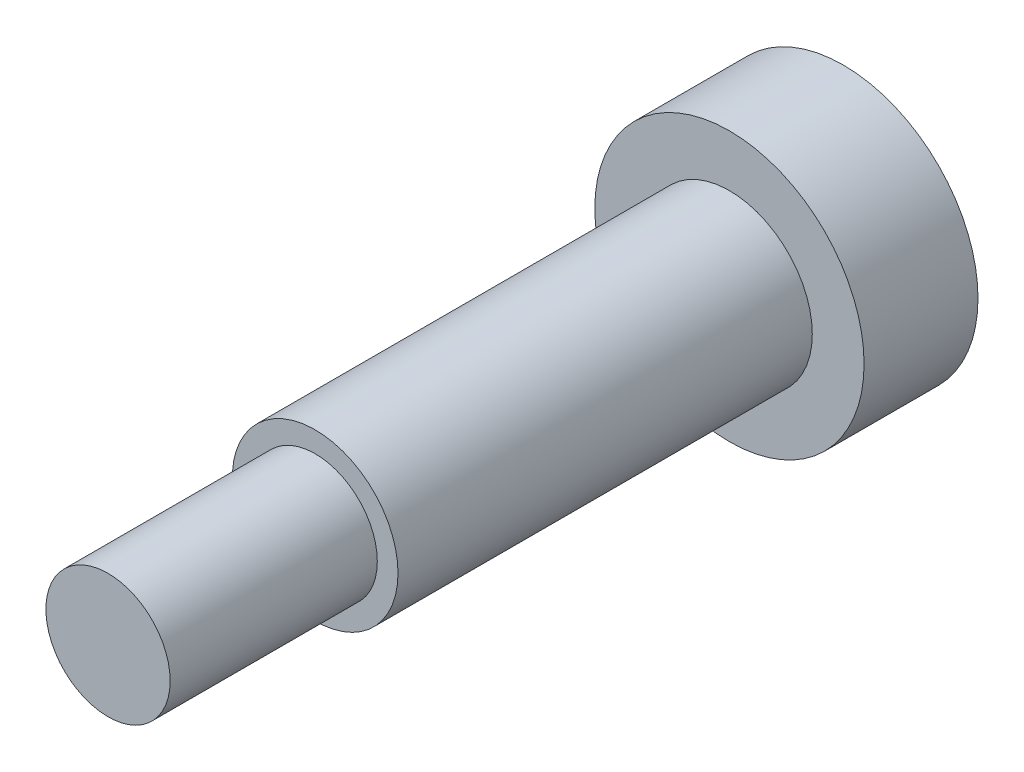
ISO-10303-21;
HEADER;
FILE_DESCRIPTION(('STEP AP214'),'2;1');
FILE_NAME('part.step','',(''),(''),'','','');
FILE_SCHEMA(('AUTOMOTIVE_DESIGN { 1 0 10303 214 1 1 1 1 }'));
ENDSEC;
DATA;
#1=APPLICATION_CONTEXT('core data for automotive mechanical design processes');
#2=APPLICATION_PROTOCOL_DEFINITION('international standard','automotive_design',2000,#1);
#3=PRODUCT_CONTEXT('',#1,'mechanical');
#4=PRODUCT('Part','Part','',(#3));
#5=PRODUCT_RELATED_PRODUCT_CATEGORY('part','',(#4));
#6=PRODUCT_DEFINITION_FORMATION('','',#4);
#7=PRODUCT_DEFINITION_CONTEXT('part definition',#1,'design');
#8=PRODUCT_DEFINITION('design','',#6,#7);
#9=PRODUCT_DEFINITION_SHAPE('','',#8);
#10=(LENGTH_UNIT() NAMED_UNIT(*) SI_UNIT(.MILLI.,.METRE.));
#11=(NAMED_UNIT(*) PLANE_ANGLE_UNIT() SI_UNIT($,.RADIAN.));
#12=(NAMED_UNIT(*) SI_UNIT($,.STERADIAN.) SOLID_ANGLE_UNIT());
#13=UNCERTAINTY_MEASURE_WITH_UNIT(LENGTH_MEASURE(1.E-05),#10,'distance_accuracy_value','');
#14=(GEOMETRIC_REPRESENTATION_CONTEXT(3) GLOBAL_UNCERTAINTY_ASSIGNED_CONTEXT((#13)) GLOBAL_UNIT_ASSIGNED_CONTEXT((#10,
#11,#12)) REPRESENTATION_CONTEXT('',''));
#15=CARTESIAN_POINT('',(0.,0.,0.));
#16=DIRECTION('',(0.,0.,1.));
#17=DIRECTION('',(1.,0.,0.));
#18=AXIS2_PLACEMENT_3D('',#15,#16,#17);
#19=CARTESIAN_POINT('',(0.,0.,20.));
#20=DIRECTION('',(0.,0.,-1.));
#21=DIRECTION('',(-1.,0.,0.));
#22=AXIS2_PLACEMENT_3D('',#19,#20,#21);
#23=CYLINDRICAL_SURFACE('',#22,4.);
#24=CARTESIAN_POINT('',(0.,0.,20.));
#25=DIRECTION('',(0.,0.,1.));
#26=DIRECTION('',(1.,0.,0.));
#27=AXIS2_PLACEMENT_3D('',#24,#25,#26);
#28=CIRCLE('',#27,4.);
#29=CARTESIAN_POINT('',(4.,0.,20.));
#30=VERTEX_POINT('',#29);
#31=EDGE_CURVE('E41',#30,#30,#28,.T.);
#32=ORIENTED_EDGE('',*,*,#31,.F.);
#33=EDGE_LOOP('',(#32));
#34=FACE_BOUND('',#33,.T.);
#35=CARTESIAN_POINT('',(0.,0.,0.));
#36=DIRECTION('',(0.,0.,1.));
#37=DIRECTION('',(1.,0.,0.));
#38=AXIS2_PLACEMENT_3D('',#35,#36,#37);
#39=CIRCLE('',#38,4.);
#40=CARTESIAN_POINT('',(4.,0.,0.));
#41=VERTEX_POINT('',#40);
#42=EDGE_CURVE('E37',#41,#41,#39,.T.);
#43=ORIENTED_EDGE('',*,*,#42,.T.);
#44=EDGE_LOOP('',(#43));
#45=FACE_BOUND('',#44,.T.);
#46=ADVANCED_FACE('F34',(#34,#45),#23,.T.);
#47=CARTESIAN_POINT('',(0.,0.,20.));
#48=DIRECTION('',(0.,0.,1.));
#49=DIRECTION('',(1.,0.,0.));
#50=AXIS2_PLACEMENT_3D('',#47,#48,#49);
#51=PLANE('',#50);
#52=CARTESIAN_POINT('',(0.,0.,20.));
#53=DIRECTION('',(0.,0.,1.));
#54=DIRECTION('',(1.,0.,0.));
#55=AXIS2_PLACEMENT_3D('',#52,#53,#54);
#56=CIRCLE('',#55,3.);
#57=CARTESIAN_POINT('',(3.,0.,20.));
#58=VERTEX_POINT('',#57);
#59=EDGE_CURVE('E10',#58,#58,#56,.T.);
#60=ORIENTED_EDGE('',*,*,#59,.F.);
#61=EDGE_LOOP('',(#60));
#62=FACE_BOUND('',#61,.T.);
#63=ORIENTED_EDGE('',*,*,#31,.T.);
#64=EDGE_LOOP('',(#63));
#65=FACE_BOUND('',#64,.T.);
#66=ADVANCED_FACE('F75',(#62,#65),#51,.T.);
#67=CARTESIAN_POINT('',(0.,0.,-5.5));
#68=DIRECTION('',(0.,0.,1.));
#69=DIRECTION('',(1.,0.,0.));
#70=AXIS2_PLACEMENT_3D('',#67,#68,#69);
#71=CYLINDRICAL_SURFACE('',#70,6.5);
#72=CARTESIAN_POINT('',(0.,0.,-5.5));
#73=DIRECTION('',(0.,0.,-1.));
#74=DIRECTION('',(-1.,0.,0.));
#75=AXIS2_PLACEMENT_3D('',#72,#73,#74);
#76=CIRCLE('',#75,6.5);
#77=CARTESIAN_POINT('',(-6.5,0.,-5.5));
#78=VERTEX_POINT('',#77);
#79=EDGE_CURVE('E49',#78,#78,#76,.T.);
#80=ORIENTED_EDGE('',*,*,#79,.F.);
#81=EDGE_LOOP('',(#80));
#82=FACE_BOUND('',#81,.T.);
#83=CARTESIAN_POINT('',(0.,0.,0.));
#84=DIRECTION('',(0.,0.,-1.));
#85=DIRECTION('',(-1.,0.,0.));
#86=AXIS2_PLACEMENT_3D('',#83,#84,#85);
#87=CIRCLE('',#86,6.5);
#88=CARTESIAN_POINT('',(-6.5,0.,0.));
#89=VERTEX_POINT('',#88);
#90=EDGE_CURVE('E52',#89,#89,#87,.T.);
#91=ORIENTED_EDGE('',*,*,#90,.T.);
#92=EDGE_LOOP('',(#91));
#93=FACE_BOUND('',#92,.T.);
#94=ADVANCED_FACE('F80',(#82,#93),#71,.T.);
#95=CARTESIAN_POINT('',(0.,0.,-5.5));
#96=DIRECTION('',(0.,0.,-1.));
#97=DIRECTION('',(-1.,0.,0.));
#98=AXIS2_PLACEMENT_3D('',#95,#96,#97);
#99=PLANE('',#98);
#100=ORIENTED_EDGE('',*,*,#79,.T.);
#101=EDGE_LOOP('',(#100));
#102=FACE_BOUND('',#101,.T.);
#103=ADVANCED_FACE('F70',(#102),#99,.T.);
#104=CARTESIAN_POINT('',(0.,0.,0.));
#105=DIRECTION('',(0.,0.,-1.));
#106=DIRECTION('',(-1.,0.,0.));
#107=AXIS2_PLACEMENT_3D('',#104,#105,#106);
#108=PLANE('',#107);
#109=ORIENTED_EDGE('',*,*,#42,.F.);
#110=EDGE_LOOP('',(#109));
#111=FACE_BOUND('',#110,.T.);
#112=ORIENTED_EDGE('',*,*,#90,.F.);
#113=EDGE_LOOP('',(#112));
#114=FACE_BOUND('',#113,.T.);
#115=ADVANCED_FACE('F63',(#111,#114),#108,.F.);
#116=CARTESIAN_POINT('',(0.,0.,30.));
#117=DIRECTION('',(0.,0.,-1.));
#118=DIRECTION('',(-1.,0.,0.));
#119=AXIS2_PLACEMENT_3D('',#116,#117,#118);
#120=CYLINDRICAL_SURFACE('',#119,3.);
#121=CARTESIAN_POINT('',(0.,0.,30.));
#122=DIRECTION('',(0.,0.,1.));
#123=DIRECTION('',(1.,0.,0.));
#124=AXIS2_PLACEMENT_3D('',#121,#122,#123);
#125=CIRCLE('',#124,3.);
#126=CARTESIAN_POINT('',(3.,0.,30.));
#127=VERTEX_POINT('',#126);
#128=EDGE_CURVE('E48',#127,#127,#125,.T.);
#129=ORIENTED_EDGE('',*,*,#128,.F.);
#130=EDGE_LOOP('',(#129));
#131=FACE_BOUND('',#130,.T.);
#132=ORIENTED_EDGE('',*,*,#59,.T.);
#133=EDGE_LOOP('',(#132));
#134=FACE_BOUND('',#133,.T.);
#135=ADVANCED_FACE('F61',(#131,#134),#120,.T.);
#136=CARTESIAN_POINT('',(0.,0.,30.));
#137=DIRECTION('',(0.,0.,1.));
#138=DIRECTION('',(1.,0.,0.));
#139=AXIS2_PLACEMENT_3D('',#136,#137,#138);
#140=PLANE('',#139);
#141=ORIENTED_EDGE('',*,*,#128,.T.);
#142=EDGE_LOOP('',(#141));
#143=FACE_BOUND('',#142,.T.);
#144=ADVANCED_FACE('F59',(#143),#140,.T.);
#145=CLOSED_SHELL('',(#46,#66,#94,#103,#115,#135,#144));
#146=MANIFOLD_SOLID_BREP('B2',#145);
#147=ADVANCED_BREP_SHAPE_REPRESENTATION('',(#18,#146),#14);
#148=SHAPE_DEFINITION_REPRESENTATION(#9,#147);
ENDSEC;
END-ISO-10303-21;
